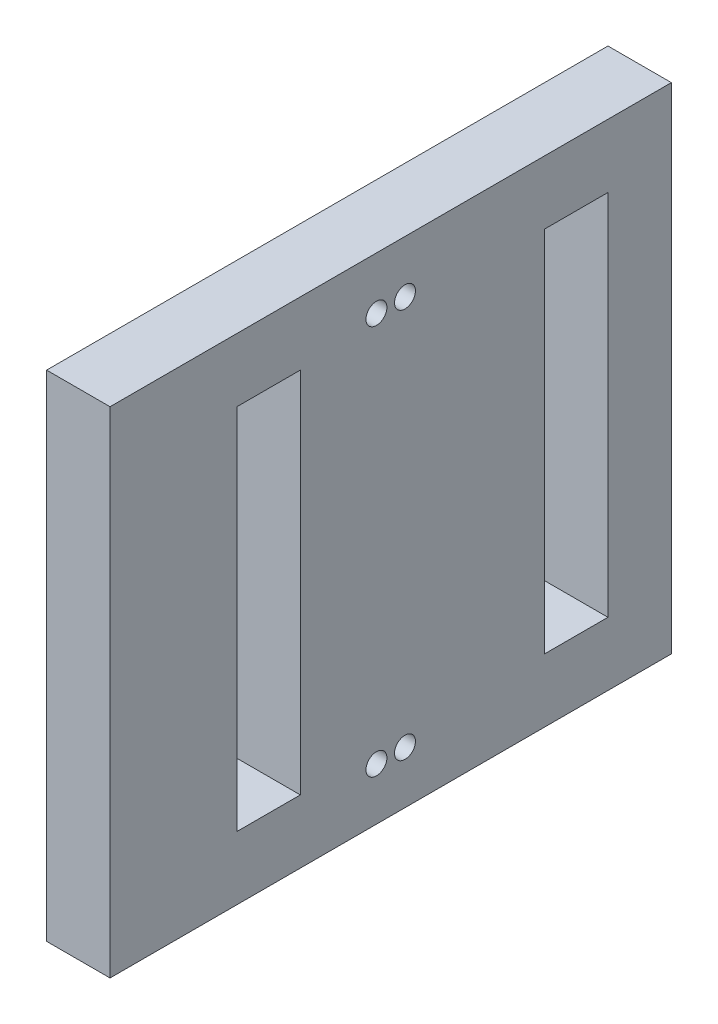
ISO-10303-21;
HEADER;
FILE_DESCRIPTION(('STEP AP214'),'2;1');
FILE_NAME('part.step','',(''),(''),'','','');
FILE_SCHEMA(('AUTOMOTIVE_DESIGN { 1 0 10303 214 1 1 1 1 }'));
ENDSEC;
DATA;
#1=APPLICATION_CONTEXT('core data for automotive mechanical design processes');
#2=APPLICATION_PROTOCOL_DEFINITION('international standard','automotive_design',2000,#1);
#3=PRODUCT_CONTEXT('',#1,'mechanical');
#4=PRODUCT('Part','Part','',(#3));
#5=PRODUCT_RELATED_PRODUCT_CATEGORY('part','',(#4));
#6=PRODUCT_DEFINITION_FORMATION('','',#4);
#7=PRODUCT_DEFINITION_CONTEXT('part definition',#1,'design');
#8=PRODUCT_DEFINITION('design','',#6,#7);
#9=PRODUCT_DEFINITION_SHAPE('','',#8);
#10=(LENGTH_UNIT() NAMED_UNIT(*) SI_UNIT(.MILLI.,.METRE.));
#11=(NAMED_UNIT(*) PLANE_ANGLE_UNIT() SI_UNIT($,.RADIAN.));
#12=(NAMED_UNIT(*) SI_UNIT($,.STERADIAN.) SOLID_ANGLE_UNIT());
#13=UNCERTAINTY_MEASURE_WITH_UNIT(LENGTH_MEASURE(1.E-05),#10,'distance_accuracy_value','');
#14=(GEOMETRIC_REPRESENTATION_CONTEXT(3) GLOBAL_UNCERTAINTY_ASSIGNED_CONTEXT((#13)) GLOBAL_UNIT_ASSIGNED_CONTEXT((#10,
#11,#12)) REPRESENTATION_CONTEXT('',''));
#15=CARTESIAN_POINT('',(0.,0.,0.));
#16=DIRECTION('',(0.,0.,1.));
#17=DIRECTION('',(1.,0.,0.));
#18=AXIS2_PLACEMENT_3D('',#15,#16,#17);
#19=CARTESIAN_POINT('',(10.,0.,0.));
#20=DIRECTION('',(1.,0.,0.));
#21=DIRECTION('',(0.,0.,-1.));
#22=AXIS2_PLACEMENT_3D('',#19,#20,#21);
#23=PLANE('',#22);
#24=CARTESIAN_POINT('',(10.,-30.75,2.25));
#25=DIRECTION('',(1.,0.,0.));
#26=DIRECTION('',(0.,0.,-1.));
#27=AXIS2_PLACEMENT_3D('',#24,#25,#26);
#28=CIRCLE('',#27,1.64999999999999);
#29=CARTESIAN_POINT('',(10.,-30.75,0.600000000000008));
#30=VERTEX_POINT('',#29);
#31=EDGE_CURVE('E366',#30,#30,#28,.T.);
#32=ORIENTED_EDGE('',*,*,#31,.F.);
#33=EDGE_LOOP('',(#32));
#34=FACE_BOUND('',#33,.T.);
#35=CARTESIAN_POINT('',(10.,30.75,2.25));
#36=DIRECTION('',(1.,0.,0.));
#37=DIRECTION('',(0.,0.,-1.));
#38=AXIS2_PLACEMENT_3D('',#35,#36,#37);
#39=CIRCLE('',#38,1.64999999999999);
#40=CARTESIAN_POINT('',(10.,30.75,0.600000000000008));
#41=VERTEX_POINT('',#40);
#42=EDGE_CURVE('E370',#41,#41,#39,.T.);
#43=ORIENTED_EDGE('',*,*,#42,.F.);
#44=EDGE_LOOP('',(#43));
#45=FACE_BOUND('',#44,.T.);
#46=CARTESIAN_POINT('',(10.,-30.75,-2.25000000000001));
#47=DIRECTION('',(1.,0.,0.));
#48=DIRECTION('',(0.,0.,-1.));
#49=AXIS2_PLACEMENT_3D('',#46,#47,#48);
#50=CIRCLE('',#49,1.64999999999999);
#51=CARTESIAN_POINT('',(10.,-30.75,-3.9));
#52=VERTEX_POINT('',#51);
#53=EDGE_CURVE('E380',#52,#52,#50,.T.);
#54=ORIENTED_EDGE('',*,*,#53,.F.);
#55=EDGE_LOOP('',(#54));
#56=FACE_BOUND('',#55,.T.);
#57=CARTESIAN_POINT('',(10.,30.75,-2.25));
#58=DIRECTION('',(1.,0.,0.));
#59=DIRECTION('',(0.,0.,-1.));
#60=AXIS2_PLACEMENT_3D('',#57,#58,#59);
#61=CIRCLE('',#60,1.64999999999999);
#62=CARTESIAN_POINT('',(10.,30.75,-3.89999999999999));
#63=VERTEX_POINT('',#62);
#64=EDGE_CURVE('E388',#63,#63,#61,.T.);
#65=ORIENTED_EDGE('',*,*,#64,.F.);
#66=EDGE_LOOP('',(#65));
#67=FACE_BOUND('',#66,.T.);
#68=DIRECTION('',(0.,1.,0.));
#69=VECTOR('',#68,1.);
#70=CARTESIAN_POINT('',(10.,39.,-44.25));
#71=LINE('',#70,#69);
#72=CARTESIAN_POINT('',(10.,-39.,-44.25));
#73=VERTEX_POINT('',#72);
#74=CARTESIAN_POINT('',(10.,39.,-44.25));
#75=VERTEX_POINT('',#74);
#76=EDGE_CURVE('E226',#73,#75,#71,.T.);
#77=ORIENTED_EDGE('',*,*,#76,.T.);
#78=DIRECTION('',(0.,0.,1.));
#79=VECTOR('',#78,1.);
#80=CARTESIAN_POINT('',(10.,39.,44.25));
#81=LINE('',#80,#79);
#82=CARTESIAN_POINT('',(10.,39.,44.25));
#83=VERTEX_POINT('',#82);
#84=EDGE_CURVE('E230',#75,#83,#81,.T.);
#85=ORIENTED_EDGE('',*,*,#84,.T.);
#86=DIRECTION('',(0.,-1.,0.));
#87=VECTOR('',#86,1.);
#88=CARTESIAN_POINT('',(10.,39.,44.25));
#89=LINE('',#88,#87);
#90=CARTESIAN_POINT('',(10.,-39.,44.25));
#91=VERTEX_POINT('',#90);
#92=EDGE_CURVE('E234',#83,#91,#89,.T.);
#93=ORIENTED_EDGE('',*,*,#92,.T.);
#94=DIRECTION('',(0.,0.,-1.));
#95=VECTOR('',#94,1.);
#96=CARTESIAN_POINT('',(10.,-39.,44.25));
#97=LINE('',#96,#95);
#98=EDGE_CURVE('E237',#91,#73,#97,.T.);
#99=ORIENTED_EDGE('',*,*,#98,.T.);
#100=EDGE_LOOP('',(#77,#85,#93,#99));
#101=FACE_BOUND('',#100,.T.);
#102=DIRECTION('',(0.,0.,1.));
#103=VECTOR('',#102,1.);
#104=CARTESIAN_POINT('',(10.,29.,24.25));
#105=LINE('',#104,#103);
#106=CARTESIAN_POINT('',(10.,29.,14.25));
#107=VERTEX_POINT('',#106);
#108=CARTESIAN_POINT('',(10.,29.,24.25));
#109=VERTEX_POINT('',#108);
#110=EDGE_CURVE('E186',#107,#109,#105,.T.);
#111=ORIENTED_EDGE('',*,*,#110,.F.);
#112=DIRECTION('',(0.,1.,0.));
#113=VECTOR('',#112,1.);
#114=CARTESIAN_POINT('',(10.,29.,14.25));
#115=LINE('',#114,#113);
#116=CARTESIAN_POINT('',(10.,-29.,14.25));
#117=VERTEX_POINT('',#116);
#118=EDGE_CURVE('E183',#117,#107,#115,.T.);
#119=ORIENTED_EDGE('',*,*,#118,.F.);
#120=DIRECTION('',(0.,0.,-1.));
#121=VECTOR('',#120,1.);
#122=CARTESIAN_POINT('',(10.,-29.,24.25));
#123=LINE('',#122,#121);
#124=CARTESIAN_POINT('',(10.,-29.,24.25));
#125=VERTEX_POINT('',#124);
#126=EDGE_CURVE('E194',#125,#117,#123,.T.);
#127=ORIENTED_EDGE('',*,*,#126,.F.);
#128=DIRECTION('',(0.,-1.,0.));
#129=VECTOR('',#128,1.);
#130=CARTESIAN_POINT('',(10.,29.,24.25));
#131=LINE('',#130,#129);
#132=EDGE_CURVE('E190',#109,#125,#131,.T.);
#133=ORIENTED_EDGE('',*,*,#132,.F.);
#134=EDGE_LOOP('',(#111,#119,#127,#133));
#135=FACE_BOUND('',#134,.T.);
#136=DIRECTION('',(0.,-1.,0.));
#137=VECTOR('',#136,1.);
#138=CARTESIAN_POINT('',(10.,29.,-24.25));
#139=LINE('',#138,#137);
#140=CARTESIAN_POINT('',(10.,29.,-24.25));
#141=VERTEX_POINT('',#140);
#142=CARTESIAN_POINT('',(10.,-29.,-24.25));
#143=VERTEX_POINT('',#142);
#144=EDGE_CURVE('E142',#141,#143,#139,.T.);
#145=ORIENTED_EDGE('',*,*,#144,.F.);
#146=DIRECTION('',(0.,0.,1.));
#147=VECTOR('',#146,1.);
#148=CARTESIAN_POINT('',(10.,29.,-34.25));
#149=LINE('',#148,#147);
#150=CARTESIAN_POINT('',(10.,29.,-34.25));
#151=VERTEX_POINT('',#150);
#152=EDGE_CURVE('E133',#151,#141,#149,.T.);
#153=ORIENTED_EDGE('',*,*,#152,.F.);
#154=DIRECTION('',(0.,1.,0.));
#155=VECTOR('',#154,1.);
#156=CARTESIAN_POINT('',(10.,29.,-34.25));
#157=LINE('',#156,#155);
#158=CARTESIAN_POINT('',(10.,-29.,-34.25));
#159=VERTEX_POINT('',#158);
#160=EDGE_CURVE('E159',#159,#151,#157,.T.);
#161=ORIENTED_EDGE('',*,*,#160,.F.);
#162=DIRECTION('',(0.,0.,-1.));
#163=VECTOR('',#162,1.);
#164=CARTESIAN_POINT('',(10.,-29.,-34.25));
#165=LINE('',#164,#163);
#166=EDGE_CURVE('E155',#143,#159,#165,.T.);
#167=ORIENTED_EDGE('',*,*,#166,.F.);
#168=EDGE_LOOP('',(#145,#153,#161,#167));
#169=FACE_BOUND('',#168,.T.);
#170=ADVANCED_FACE('F43',(#34,#45,#56,#67,#101,#135,#169),#23,.T.);
#171=CARTESIAN_POINT('',(0.,0.,0.));
#172=DIRECTION('',(1.,0.,0.));
#173=DIRECTION('',(0.,0.,-1.));
#174=AXIS2_PLACEMENT_3D('',#171,#172,#173);
#175=PLANE('',#174);
#176=CARTESIAN_POINT('',(0.,-30.75,2.25));
#177=DIRECTION('',(1.,0.,0.));
#178=DIRECTION('',(0.,0.,-1.));
#179=AXIS2_PLACEMENT_3D('',#176,#177,#178);
#180=CIRCLE('',#179,1.65);
#181=CARTESIAN_POINT('',(0.,-30.75,0.600000000000001));
#182=VERTEX_POINT('',#181);
#183=EDGE_CURVE('E364',#182,#182,#180,.T.);
#184=ORIENTED_EDGE('',*,*,#183,.T.);
#185=EDGE_LOOP('',(#184));
#186=FACE_BOUND('',#185,.T.);
#187=CARTESIAN_POINT('',(0.,30.75,2.25));
#188=DIRECTION('',(1.,0.,0.));
#189=DIRECTION('',(0.,0.,-1.));
#190=AXIS2_PLACEMENT_3D('',#187,#188,#189);
#191=CIRCLE('',#190,1.65);
#192=CARTESIAN_POINT('',(0.,30.75,0.600000000000001));
#193=VERTEX_POINT('',#192);
#194=EDGE_CURVE('E376',#193,#193,#191,.T.);
#195=ORIENTED_EDGE('',*,*,#194,.T.);
#196=EDGE_LOOP('',(#195));
#197=FACE_BOUND('',#196,.T.);
#198=CARTESIAN_POINT('',(0.,-30.75,-2.25000000000001));
#199=DIRECTION('',(1.,0.,0.));
#200=DIRECTION('',(0.,0.,-1.));
#201=AXIS2_PLACEMENT_3D('',#198,#199,#200);
#202=CIRCLE('',#201,1.65);
#203=CARTESIAN_POINT('',(0.,-30.75,-3.90000000000001));
#204=VERTEX_POINT('',#203);
#205=EDGE_CURVE('E384',#204,#204,#202,.T.);
#206=ORIENTED_EDGE('',*,*,#205,.T.);
#207=EDGE_LOOP('',(#206));
#208=FACE_BOUND('',#207,.T.);
#209=CARTESIAN_POINT('',(0.,30.75,-2.25));
#210=DIRECTION('',(1.,0.,0.));
#211=DIRECTION('',(0.,0.,-1.));
#212=AXIS2_PLACEMENT_3D('',#209,#210,#211);
#213=CIRCLE('',#212,1.65);
#214=CARTESIAN_POINT('',(0.,30.75,-3.89999999999999));
#215=VERTEX_POINT('',#214);
#216=EDGE_CURVE('E167',#215,#215,#213,.T.);
#217=ORIENTED_EDGE('',*,*,#216,.T.);
#218=EDGE_LOOP('',(#217));
#219=FACE_BOUND('',#218,.T.);
#220=DIRECTION('',(0.,1.,0.));
#221=VECTOR('',#220,1.);
#222=CARTESIAN_POINT('',(0.,29.,14.25));
#223=LINE('',#222,#221);
#224=CARTESIAN_POINT('',(0.,-29.,14.25));
#225=VERTEX_POINT('',#224);
#226=CARTESIAN_POINT('',(0.,29.,14.25));
#227=VERTEX_POINT('',#226);
#228=EDGE_CURVE('E151',#225,#227,#223,.T.);
#229=ORIENTED_EDGE('',*,*,#228,.T.);
#230=DIRECTION('',(0.,0.,1.));
#231=VECTOR('',#230,1.);
#232=CARTESIAN_POINT('',(0.,29.,24.25));
#233=LINE('',#232,#231);
#234=CARTESIAN_POINT('',(0.,29.,24.25));
#235=VERTEX_POINT('',#234);
#236=EDGE_CURVE('E201',#227,#235,#233,.T.);
#237=ORIENTED_EDGE('',*,*,#236,.T.);
#238=DIRECTION('',(0.,-1.,0.));
#239=VECTOR('',#238,1.);
#240=CARTESIAN_POINT('',(0.,29.,24.25));
#241=LINE('',#240,#239);
#242=CARTESIAN_POINT('',(0.,-29.,24.25));
#243=VERTEX_POINT('',#242);
#244=EDGE_CURVE('E205',#235,#243,#241,.T.);
#245=ORIENTED_EDGE('',*,*,#244,.T.);
#246=DIRECTION('',(0.,0.,-1.));
#247=VECTOR('',#246,1.);
#248=CARTESIAN_POINT('',(0.,-29.,24.25));
#249=LINE('',#248,#247);
#250=EDGE_CURVE('E187',#243,#225,#249,.T.);
#251=ORIENTED_EDGE('',*,*,#250,.T.);
#252=EDGE_LOOP('',(#229,#237,#245,#251));
#253=FACE_BOUND('',#252,.T.);
#254=DIRECTION('',(0.,1.,0.));
#255=VECTOR('',#254,1.);
#256=CARTESIAN_POINT('',(0.,39.,-44.25));
#257=LINE('',#256,#255);
#258=CARTESIAN_POINT('',(0.,-39.,-44.25));
#259=VERTEX_POINT('',#258);
#260=CARTESIAN_POINT('',(0.,39.,-44.25));
#261=VERTEX_POINT('',#260);
#262=EDGE_CURVE('E225',#259,#261,#257,.T.);
#263=ORIENTED_EDGE('',*,*,#262,.F.);
#264=DIRECTION('',(0.,0.,-1.));
#265=VECTOR('',#264,1.);
#266=CARTESIAN_POINT('',(0.,-39.,44.25));
#267=LINE('',#266,#265);
#268=CARTESIAN_POINT('',(0.,-39.,44.25));
#269=VERTEX_POINT('',#268);
#270=EDGE_CURVE('E231',#269,#259,#267,.T.);
#271=ORIENTED_EDGE('',*,*,#270,.F.);
#272=DIRECTION('',(0.,-1.,0.));
#273=VECTOR('',#272,1.);
#274=CARTESIAN_POINT('',(0.,39.,44.25));
#275=LINE('',#274,#273);
#276=CARTESIAN_POINT('',(0.,39.,44.25));
#277=VERTEX_POINT('',#276);
#278=EDGE_CURVE('E247',#277,#269,#275,.T.);
#279=ORIENTED_EDGE('',*,*,#278,.F.);
#280=DIRECTION('',(0.,0.,1.));
#281=VECTOR('',#280,1.);
#282=CARTESIAN_POINT('',(0.,39.,44.25));
#283=LINE('',#282,#281);
#284=EDGE_CURVE('E244',#261,#277,#283,.T.);
#285=ORIENTED_EDGE('',*,*,#284,.F.);
#286=EDGE_LOOP('',(#263,#271,#279,#285));
#287=FACE_BOUND('',#286,.T.);
#288=DIRECTION('',(0.,0.,1.));
#289=VECTOR('',#288,1.);
#290=CARTESIAN_POINT('',(0.,29.,-34.25));
#291=LINE('',#290,#289);
#292=CARTESIAN_POINT('',(0.,29.,-34.25));
#293=VERTEX_POINT('',#292);
#294=CARTESIAN_POINT('',(0.,29.,-24.25));
#295=VERTEX_POINT('',#294);
#296=EDGE_CURVE('E67',#293,#295,#291,.T.);
#297=ORIENTED_EDGE('',*,*,#296,.T.);
#298=DIRECTION('',(0.,-1.,0.));
#299=VECTOR('',#298,1.);
#300=CARTESIAN_POINT('',(0.,29.,-24.25));
#301=LINE('',#300,#299);
#302=CARTESIAN_POINT('',(0.,-29.,-24.25));
#303=VERTEX_POINT('',#302);
#304=EDGE_CURVE('E149',#295,#303,#301,.T.);
#305=ORIENTED_EDGE('',*,*,#304,.T.);
#306=DIRECTION('',(0.,0.,-1.));
#307=VECTOR('',#306,1.);
#308=CARTESIAN_POINT('',(0.,-29.,-34.25));
#309=LINE('',#308,#307);
#310=CARTESIAN_POINT('',(0.,-29.,-34.25));
#311=VERTEX_POINT('',#310);
#312=EDGE_CURVE('E170',#303,#311,#309,.T.);
#313=ORIENTED_EDGE('',*,*,#312,.T.);
#314=DIRECTION('',(0.,1.,0.));
#315=VECTOR('',#314,1.);
#316=CARTESIAN_POINT('',(0.,29.,-34.25));
#317=LINE('',#316,#315);
#318=EDGE_CURVE('E143',#311,#293,#317,.T.);
#319=ORIENTED_EDGE('',*,*,#318,.T.);
#320=EDGE_LOOP('',(#297,#305,#313,#319));
#321=FACE_BOUND('',#320,.T.);
#322=ADVANCED_FACE('F270',(#186,#197,#208,#219,#253,#287,#321),#175,.F.);
#323=CARTESIAN_POINT('',(10.,39.,-44.25));
#324=DIRECTION('',(0.,0.,1.));
#325=DIRECTION('',(0.,-1.,0.));
#326=AXIS2_PLACEMENT_3D('',#323,#324,#325);
#327=PLANE('',#326);
#328=ORIENTED_EDGE('',*,*,#262,.T.);
#329=DIRECTION('',(-1.,0.,0.));
#330=VECTOR('',#329,1.);
#331=CARTESIAN_POINT('',(10.,39.,-44.25));
#332=LINE('',#331,#330);
#333=EDGE_CURVE('E11',#75,#261,#332,.T.);
#334=ORIENTED_EDGE('',*,*,#333,.F.);
#335=ORIENTED_EDGE('',*,*,#76,.F.);
#336=DIRECTION('',(-1.,0.,0.));
#337=VECTOR('',#336,1.);
#338=CARTESIAN_POINT('',(10.,-39.,-44.25));
#339=LINE('',#338,#337);
#340=EDGE_CURVE('E240',#73,#259,#339,.T.);
#341=ORIENTED_EDGE('',*,*,#340,.T.);
#342=EDGE_LOOP('',(#328,#334,#335,#341));
#343=FACE_BOUND('',#342,.T.);
#344=ADVANCED_FACE('F45',(#343),#327,.F.);
#345=CARTESIAN_POINT('',(10.,39.,44.25));
#346=DIRECTION('',(0.,-1.,0.));
#347=DIRECTION('',(0.,0.,-1.));
#348=AXIS2_PLACEMENT_3D('',#345,#346,#347);
#349=PLANE('',#348);
#350=ORIENTED_EDGE('',*,*,#284,.T.);
#351=DIRECTION('',(-1.,0.,0.));
#352=VECTOR('',#351,1.);
#353=CARTESIAN_POINT('',(10.,39.,44.25));
#354=LINE('',#353,#352);
#355=EDGE_CURVE('E52',#83,#277,#354,.T.);
#356=ORIENTED_EDGE('',*,*,#355,.F.);
#357=ORIENTED_EDGE('',*,*,#84,.F.);
#358=ORIENTED_EDGE('',*,*,#333,.T.);
#359=EDGE_LOOP('',(#350,#356,#357,#358));
#360=FACE_BOUND('',#359,.T.);
#361=ADVANCED_FACE('F281',(#360),#349,.F.);
#362=CARTESIAN_POINT('',(10.,39.,44.25));
#363=DIRECTION('',(0.,0.,-1.));
#364=DIRECTION('',(0.,1.,0.));
#365=AXIS2_PLACEMENT_3D('',#362,#363,#364);
#366=PLANE('',#365);
#367=ORIENTED_EDGE('',*,*,#278,.T.);
#368=DIRECTION('',(-1.,0.,0.));
#369=VECTOR('',#368,1.);
#370=CARTESIAN_POINT('',(10.,-39.,44.25));
#371=LINE('',#370,#369);
#372=EDGE_CURVE('E255',#91,#269,#371,.T.);
#373=ORIENTED_EDGE('',*,*,#372,.F.);
#374=ORIENTED_EDGE('',*,*,#92,.F.);
#375=ORIENTED_EDGE('',*,*,#355,.T.);
#376=EDGE_LOOP('',(#367,#373,#374,#375));
#377=FACE_BOUND('',#376,.T.);
#378=ADVANCED_FACE('F264',(#377),#366,.F.);
#379=CARTESIAN_POINT('',(10.,-39.,44.25));
#380=DIRECTION('',(0.,1.,0.));
#381=DIRECTION('',(0.,0.,1.));
#382=AXIS2_PLACEMENT_3D('',#379,#380,#381);
#383=PLANE('',#382);
#384=ORIENTED_EDGE('',*,*,#270,.T.);
#385=ORIENTED_EDGE('',*,*,#340,.F.);
#386=ORIENTED_EDGE('',*,*,#98,.F.);
#387=ORIENTED_EDGE('',*,*,#372,.T.);
#388=EDGE_LOOP('',(#384,#385,#386,#387));
#389=FACE_BOUND('',#388,.T.);
#390=ADVANCED_FACE('F274',(#389),#383,.F.);
#391=CARTESIAN_POINT('',(10.,29.,14.25));
#392=DIRECTION('',(0.,0.,1.));
#393=DIRECTION('',(0.,-1.,0.));
#394=AXIS2_PLACEMENT_3D('',#391,#392,#393);
#395=PLANE('',#394);
#396=ORIENTED_EDGE('',*,*,#228,.F.);
#397=DIRECTION('',(-1.,0.,0.));
#398=VECTOR('',#397,1.);
#399=CARTESIAN_POINT('',(10.,-29.,14.25));
#400=LINE('',#399,#398);
#401=EDGE_CURVE('E197',#117,#225,#400,.T.);
#402=ORIENTED_EDGE('',*,*,#401,.F.);
#403=ORIENTED_EDGE('',*,*,#118,.T.);
#404=DIRECTION('',(-1.,0.,0.));
#405=VECTOR('',#404,1.);
#406=CARTESIAN_POINT('',(10.,29.,14.25));
#407=LINE('',#406,#405);
#408=EDGE_CURVE('E221',#107,#227,#407,.T.);
#409=ORIENTED_EDGE('',*,*,#408,.T.);
#410=EDGE_LOOP('',(#396,#402,#403,#409));
#411=FACE_BOUND('',#410,.T.);
#412=ADVANCED_FACE('F299',(#411),#395,.T.);
#413=CARTESIAN_POINT('',(10.,29.,24.25));
#414=DIRECTION('',(0.,-1.,0.));
#415=DIRECTION('',(0.,0.,-1.));
#416=AXIS2_PLACEMENT_3D('',#413,#414,#415);
#417=PLANE('',#416);
#418=ORIENTED_EDGE('',*,*,#236,.F.);
#419=ORIENTED_EDGE('',*,*,#408,.F.);
#420=ORIENTED_EDGE('',*,*,#110,.T.);
#421=DIRECTION('',(-1.,0.,0.));
#422=VECTOR('',#421,1.);
#423=CARTESIAN_POINT('',(10.,29.,24.25));
#424=LINE('',#423,#422);
#425=EDGE_CURVE('E218',#109,#235,#424,.T.);
#426=ORIENTED_EDGE('',*,*,#425,.T.);
#427=EDGE_LOOP('',(#418,#419,#420,#426));
#428=FACE_BOUND('',#427,.T.);
#429=ADVANCED_FACE('F306',(#428),#417,.T.);
#430=CARTESIAN_POINT('',(10.,29.,24.25));
#431=DIRECTION('',(0.,0.,-1.));
#432=DIRECTION('',(0.,1.,0.));
#433=AXIS2_PLACEMENT_3D('',#430,#431,#432);
#434=PLANE('',#433);
#435=ORIENTED_EDGE('',*,*,#244,.F.);
#436=ORIENTED_EDGE('',*,*,#425,.F.);
#437=ORIENTED_EDGE('',*,*,#132,.T.);
#438=DIRECTION('',(-1.,0.,0.));
#439=VECTOR('',#438,1.);
#440=CARTESIAN_POINT('',(10.,-29.,24.25));
#441=LINE('',#440,#439);
#442=EDGE_CURVE('E215',#125,#243,#441,.T.);
#443=ORIENTED_EDGE('',*,*,#442,.T.);
#444=EDGE_LOOP('',(#435,#436,#437,#443));
#445=FACE_BOUND('',#444,.T.);
#446=ADVANCED_FACE('F311',(#445),#434,.T.);
#447=CARTESIAN_POINT('',(10.,-29.,24.25));
#448=DIRECTION('',(0.,1.,0.));
#449=DIRECTION('',(0.,0.,1.));
#450=AXIS2_PLACEMENT_3D('',#447,#448,#449);
#451=PLANE('',#450);
#452=ORIENTED_EDGE('',*,*,#250,.F.);
#453=ORIENTED_EDGE('',*,*,#442,.F.);
#454=ORIENTED_EDGE('',*,*,#126,.T.);
#455=ORIENTED_EDGE('',*,*,#401,.T.);
#456=EDGE_LOOP('',(#452,#453,#454,#455));
#457=FACE_BOUND('',#456,.T.);
#458=ADVANCED_FACE('F319',(#457),#451,.T.);
#459=CARTESIAN_POINT('',(10.,29.,-34.25));
#460=DIRECTION('',(0.,-1.,0.));
#461=DIRECTION('',(0.,0.,-1.));
#462=AXIS2_PLACEMENT_3D('',#459,#460,#461);
#463=PLANE('',#462);
#464=ORIENTED_EDGE('',*,*,#296,.F.);
#465=DIRECTION('',(-1.,0.,0.));
#466=VECTOR('',#465,1.);
#467=CARTESIAN_POINT('',(10.,29.,-34.25));
#468=LINE('',#467,#466);
#469=EDGE_CURVE('E137',#151,#293,#468,.T.);
#470=ORIENTED_EDGE('',*,*,#469,.F.);
#471=ORIENTED_EDGE('',*,*,#152,.T.);
#472=DIRECTION('',(-1.,0.,0.));
#473=VECTOR('',#472,1.);
#474=CARTESIAN_POINT('',(10.,29.,-24.25));
#475=LINE('',#474,#473);
#476=EDGE_CURVE('E136',#141,#295,#475,.T.);
#477=ORIENTED_EDGE('',*,*,#476,.T.);
#478=EDGE_LOOP('',(#464,#470,#471,#477));
#479=FACE_BOUND('',#478,.T.);
#480=ADVANCED_FACE('F135',(#479),#463,.T.);
#481=CARTESIAN_POINT('',(10.,29.,-24.25));
#482=DIRECTION('',(0.,0.,-1.));
#483=DIRECTION('',(0.,1.,0.));
#484=AXIS2_PLACEMENT_3D('',#481,#482,#483);
#485=PLANE('',#484);
#486=ORIENTED_EDGE('',*,*,#304,.F.);
#487=ORIENTED_EDGE('',*,*,#476,.F.);
#488=ORIENTED_EDGE('',*,*,#144,.T.);
#489=DIRECTION('',(-1.,0.,0.));
#490=VECTOR('',#489,1.);
#491=CARTESIAN_POINT('',(10.,-29.,-24.25));
#492=LINE('',#491,#490);
#493=EDGE_CURVE('E152',#143,#303,#492,.T.);
#494=ORIENTED_EDGE('',*,*,#493,.T.);
#495=EDGE_LOOP('',(#486,#487,#488,#494));
#496=FACE_BOUND('',#495,.T.);
#497=ADVANCED_FACE('F146',(#496),#485,.T.);
#498=CARTESIAN_POINT('',(10.,-29.,-34.25));
#499=DIRECTION('',(0.,1.,0.));
#500=DIRECTION('',(0.,0.,1.));
#501=AXIS2_PLACEMENT_3D('',#498,#499,#500);
#502=PLANE('',#501);
#503=ORIENTED_EDGE('',*,*,#312,.F.);
#504=ORIENTED_EDGE('',*,*,#493,.F.);
#505=ORIENTED_EDGE('',*,*,#166,.T.);
#506=DIRECTION('',(-1.,0.,0.));
#507=VECTOR('',#506,1.);
#508=CARTESIAN_POINT('',(10.,-29.,-34.25));
#509=LINE('',#508,#507);
#510=EDGE_CURVE('E59',#159,#311,#509,.T.);
#511=ORIENTED_EDGE('',*,*,#510,.T.);
#512=EDGE_LOOP('',(#503,#504,#505,#511));
#513=FACE_BOUND('',#512,.T.);
#514=ADVANCED_FACE('F337',(#513),#502,.T.);
#515=CARTESIAN_POINT('',(10.,29.,-34.25));
#516=DIRECTION('',(0.,0.,1.));
#517=DIRECTION('',(0.,-1.,0.));
#518=AXIS2_PLACEMENT_3D('',#515,#516,#517);
#519=PLANE('',#518);
#520=ORIENTED_EDGE('',*,*,#318,.F.);
#521=ORIENTED_EDGE('',*,*,#510,.F.);
#522=ORIENTED_EDGE('',*,*,#160,.T.);
#523=ORIENTED_EDGE('',*,*,#469,.T.);
#524=EDGE_LOOP('',(#520,#521,#522,#523));
#525=FACE_BOUND('',#524,.T.);
#526=ADVANCED_FACE('F340',(#525),#519,.T.);
#527=CARTESIAN_POINT('',(10.,30.75,-2.25));
#528=DIRECTION('',(1.,0.,0.));
#529=DIRECTION('',(0.,0.,-1.));
#530=AXIS2_PLACEMENT_3D('',#527,#528,#529);
#531=CYLINDRICAL_SURFACE('',#530,1.64999999999999);
#532=ORIENTED_EDGE('',*,*,#216,.F.);
#533=EDGE_LOOP('',(#532));
#534=FACE_BOUND('',#533,.T.);
#535=ORIENTED_EDGE('',*,*,#64,.T.);
#536=EDGE_LOOP('',(#535));
#537=FACE_BOUND('',#536,.T.);
#538=ADVANCED_FACE('F344',(#534,#537),#531,.F.);
#539=CARTESIAN_POINT('',(10.,-30.75,-2.25000000000001));
#540=DIRECTION('',(1.,0.,0.));
#541=DIRECTION('',(0.,0.,-1.));
#542=AXIS2_PLACEMENT_3D('',#539,#540,#541);
#543=CYLINDRICAL_SURFACE('',#542,1.64999999999999);
#544=ORIENTED_EDGE('',*,*,#205,.F.);
#545=EDGE_LOOP('',(#544));
#546=FACE_BOUND('',#545,.T.);
#547=ORIENTED_EDGE('',*,*,#53,.T.);
#548=EDGE_LOOP('',(#547));
#549=FACE_BOUND('',#548,.T.);
#550=ADVANCED_FACE('F347',(#546,#549),#543,.F.);
#551=CARTESIAN_POINT('',(10.,30.75,2.25));
#552=DIRECTION('',(1.,0.,0.));
#553=DIRECTION('',(0.,0.,-1.));
#554=AXIS2_PLACEMENT_3D('',#551,#552,#553);
#555=CYLINDRICAL_SURFACE('',#554,1.64999999999999);
#556=ORIENTED_EDGE('',*,*,#194,.F.);
#557=EDGE_LOOP('',(#556));
#558=FACE_BOUND('',#557,.T.);
#559=ORIENTED_EDGE('',*,*,#42,.T.);
#560=EDGE_LOOP('',(#559));
#561=FACE_BOUND('',#560,.T.);
#562=ADVANCED_FACE('F351',(#558,#561),#555,.F.);
#563=CARTESIAN_POINT('',(10.,-30.75,2.25));
#564=DIRECTION('',(1.,0.,0.));
#565=DIRECTION('',(0.,0.,-1.));
#566=AXIS2_PLACEMENT_3D('',#563,#564,#565);
#567=CYLINDRICAL_SURFACE('',#566,1.64999999999999);
#568=ORIENTED_EDGE('',*,*,#183,.F.);
#569=EDGE_LOOP('',(#568));
#570=FACE_BOUND('',#569,.T.);
#571=ORIENTED_EDGE('',*,*,#31,.T.);
#572=EDGE_LOOP('',(#571));
#573=FACE_BOUND('',#572,.T.);
#574=ADVANCED_FACE('F355',(#570,#573),#567,.F.);
#575=CLOSED_SHELL('',(#170,#322,#344,#361,#378,#390,#412,#429,#446,#458,#480,#497,#514,#526,
#538,#550,#562,#574));
#576=MANIFOLD_SOLID_BREP('B2',#575);
#577=ADVANCED_BREP_SHAPE_REPRESENTATION('',(#18,#576),#14);
#578=SHAPE_DEFINITION_REPRESENTATION(#9,#577);
ENDSEC;
END-ISO-10303-21;
